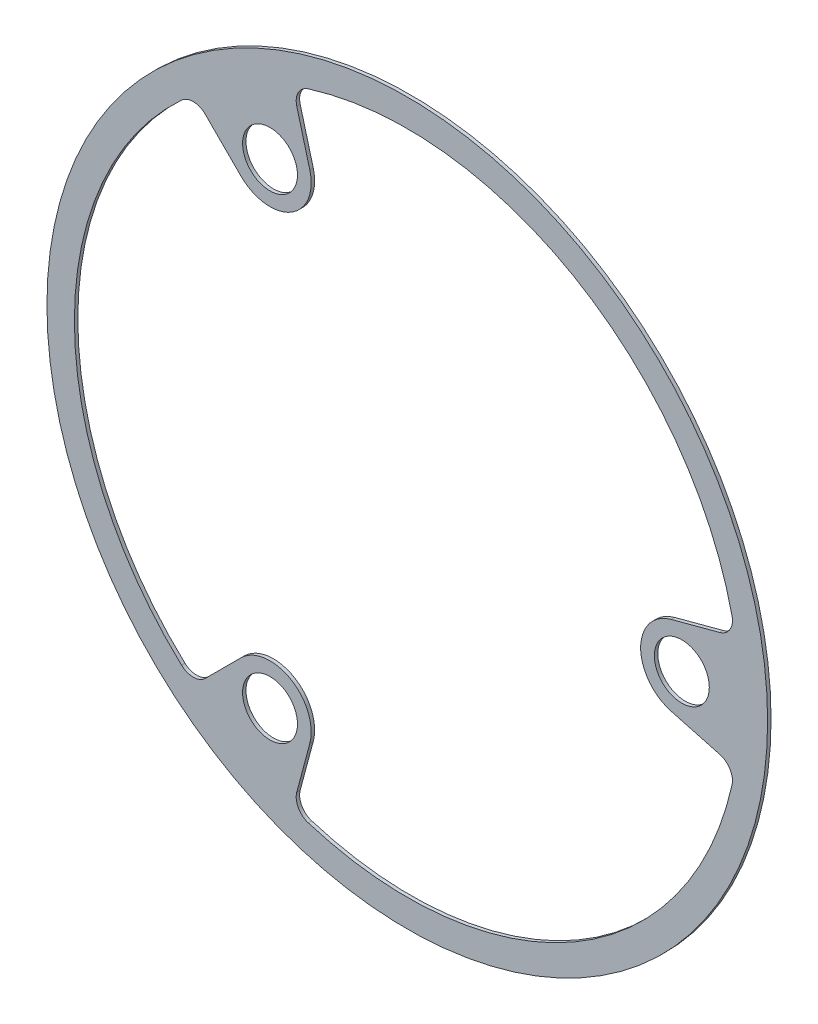
ISO-10303-21;
HEADER;
FILE_DESCRIPTION(('STEP AP214'),'2;1');
FILE_NAME('part.step','',(''),(''),'','','');
FILE_SCHEMA(('AUTOMOTIVE_DESIGN { 1 0 10303 214 1 1 1 1 }'));
ENDSEC;
DATA;
#1=APPLICATION_CONTEXT('core data for automotive mechanical design processes');
#2=APPLICATION_PROTOCOL_DEFINITION('international standard','automotive_design',2000,#1);
#3=PRODUCT_CONTEXT('',#1,'mechanical');
#4=PRODUCT('Part','Part','',(#3));
#5=PRODUCT_RELATED_PRODUCT_CATEGORY('part','',(#4));
#6=PRODUCT_DEFINITION_FORMATION('','',#4);
#7=PRODUCT_DEFINITION_CONTEXT('part definition',#1,'design');
#8=PRODUCT_DEFINITION('design','',#6,#7);
#9=PRODUCT_DEFINITION_SHAPE('','',#8);
#10=(LENGTH_UNIT() NAMED_UNIT(*) SI_UNIT(.MILLI.,.METRE.));
#11=(NAMED_UNIT(*) PLANE_ANGLE_UNIT() SI_UNIT($,.RADIAN.));
#12=(NAMED_UNIT(*) SI_UNIT($,.STERADIAN.) SOLID_ANGLE_UNIT());
#13=UNCERTAINTY_MEASURE_WITH_UNIT(LENGTH_MEASURE(1.E-05),#10,'distance_accuracy_value','');
#14=(GEOMETRIC_REPRESENTATION_CONTEXT(3) GLOBAL_UNCERTAINTY_ASSIGNED_CONTEXT((#13)) GLOBAL_UNIT_ASSIGNED_CONTEXT((#10,
#11,#12)) REPRESENTATION_CONTEXT('',''));
#15=CARTESIAN_POINT('',(0.,0.,0.));
#16=DIRECTION('',(0.,0.,1.));
#17=DIRECTION('',(1.,0.,0.));
#18=AXIS2_PLACEMENT_3D('',#15,#16,#17);
#19=CARTESIAN_POINT('',(-40.0000000000032,69.2820323027534,1.));
#20=DIRECTION('',(0.,0.,-1.));
#21=DIRECTION('',(-1.,0.,0.));
#22=AXIS2_PLACEMENT_3D('',#19,#20,#21);
#23=CYLINDRICAL_SURFACE('',#22,12.);
#24=CARTESIAN_POINT('',(-40.0000000000032,69.2820323027534,0.));
#25=DIRECTION('',(0.,0.,1.));
#26=DIRECTION('',(1.,0.,0.));
#27=AXIS2_PLACEMENT_3D('',#24,#25,#26);
#28=CIRCLE('',#27,12.);
#29=CARTESIAN_POINT('',(-28.4088900845345,72.3878608439841,0.));
#30=VERTEX_POINT('',#29);
#31=CARTESIAN_POINT('',(-48.4852813742413,60.7967509285144,0.));
#32=VERTEX_POINT('',#31);
#33=EDGE_CURVE('E192',#30,#32,#28,.F.);
#34=ORIENTED_EDGE('',*,*,#33,.F.);
#35=DIRECTION('',(0.,0.,-1.));
#36=VECTOR('',#35,1.);
#37=CARTESIAN_POINT('',(-28.4088900845345,72.3878608439841,1.));
#38=LINE('',#37,#36);
#39=CARTESIAN_POINT('',(-28.4088900845345,72.3878608439841,1.));
#40=VERTEX_POINT('',#39);
#41=EDGE_CURVE('E187',#40,#30,#38,.T.);
#42=ORIENTED_EDGE('',*,*,#41,.F.);
#43=CARTESIAN_POINT('',(-40.0000000000032,69.2820323027534,1.));
#44=DIRECTION('',(0.,0.,1.));
#45=DIRECTION('',(1.,0.,0.));
#46=AXIS2_PLACEMENT_3D('',#43,#44,#45);
#47=CIRCLE('',#46,12.);
#48=CARTESIAN_POINT('',(-48.4852813742413,60.7967509285144,1.));
#49=VERTEX_POINT('',#48);
#50=EDGE_CURVE('E189',#40,#49,#47,.F.);
#51=ORIENTED_EDGE('',*,*,#50,.T.);
#52=DIRECTION('',(0.,0.,-1.));
#53=VECTOR('',#52,1.);
#54=CARTESIAN_POINT('',(-48.4852813742413,60.7967509285144,1.));
#55=LINE('',#54,#53);
#56=EDGE_CURVE('E242',#49,#32,#55,.T.);
#57=ORIENTED_EDGE('',*,*,#56,.T.);
#58=EDGE_LOOP('',(#34,#42,#51,#57));
#59=FACE_BOUND('',#58,.T.);
#60=ADVANCED_FACE('F62',(#59),#23,.T.);
#61=CARTESIAN_POINT('',(-8.40889008453115,-2.2531553073926,1.));
#62=DIRECTION('',(-0.965925826289057,-0.258819045102564,0.));
#63=DIRECTION('',(0.258819045102564,-0.965925826289057,0.));
#64=AXIS2_PLACEMENT_3D('',#61,#62,#63);
#65=PLANE('',#64);
#66=DIRECTION('',(-0.258819045102564,0.965925826289057,0.));
#67=VECTOR('',#66,1.);
#68=CARTESIAN_POINT('',(-8.40889008453115,-2.2531553073926,0.));
#69=LINE('',#68,#67);
#70=CARTESIAN_POINT('',(-32.2009201564647,86.5399097362541,0.));
#71=VERTEX_POINT('',#70);
#72=EDGE_CURVE('E250',#30,#71,#69,.T.);
#73=ORIENTED_EDGE('',*,*,#72,.T.);
#74=DIRECTION('',(0.,0.,-1.));
#75=VECTOR('',#74,1.);
#76=CARTESIAN_POINT('',(-32.2009201564647,86.5399097362541,1.));
#77=LINE('',#76,#75);
#78=CARTESIAN_POINT('',(-32.2009201564647,86.5399097362541,1.));
#79=VERTEX_POINT('',#78);
#80=EDGE_CURVE('E77',#71,#79,#77,.F.);
#81=ORIENTED_EDGE('',*,*,#80,.T.);
#82=DIRECTION('',(-0.258819045102564,0.965925826289057,0.));
#83=VECTOR('',#82,1.);
#84=CARTESIAN_POINT('',(-8.40889008453115,-2.2531553073926,1.));
#85=LINE('',#84,#83);
#86=EDGE_CURVE('E196',#40,#79,#85,.T.);
#87=ORIENTED_EDGE('',*,*,#86,.F.);
#88=ORIENTED_EDGE('',*,*,#41,.T.);
#89=EDGE_LOOP('',(#73,#81,#87,#88));
#90=FACE_BOUND('',#89,.T.);
#91=ADVANCED_FACE('F197',(#90),#65,.F.);
#92=CARTESIAN_POINT('',(0.,0.,1.));
#93=DIRECTION('',(0.,0.,-1.));
#94=DIRECTION('',(-1.,0.,0.));
#95=AXIS2_PLACEMENT_3D('',#92,#93,#94);
#96=CYLINDRICAL_SURFACE('',#95,97.);
#97=CARTESIAN_POINT('',(0.,0.,0.));
#98=DIRECTION('',(0.,0.,1.));
#99=DIRECTION('',(1.,0.,0.));
#100=AXIS2_PLACEMENT_3D('',#97,#98,#99);
#101=CIRCLE('',#100,97.);
#102=CARTESIAN_POINT('',(94.6299580127843,21.3112891796504,0.));
#103=VERTEX_POINT('',#102);
#104=CARTESIAN_POINT('',(-28.8588611894226,92.6075921879499,0.));
#105=VERTEX_POINT('',#104);
#106=EDGE_CURVE('E252',#103,#105,#101,.T.);
#107=ORIENTED_EDGE('',*,*,#106,.F.);
#108=DIRECTION('',(0.,0.,-1.));
#109=VECTOR('',#108,1.);
#110=CARTESIAN_POINT('',(94.6299580127843,21.3112891796504,1.));
#111=LINE('',#110,#109);
#112=CARTESIAN_POINT('',(94.6299580127843,21.3112891796504,1.));
#113=VERTEX_POINT('',#112);
#114=EDGE_CURVE('E311',#103,#113,#111,.F.);
#115=ORIENTED_EDGE('',*,*,#114,.T.);
#116=CARTESIAN_POINT('',(0.,0.,1.));
#117=DIRECTION('',(0.,0.,1.));
#118=DIRECTION('',(1.,0.,0.));
#119=AXIS2_PLACEMENT_3D('',#116,#117,#118);
#120=CIRCLE('',#119,97.);
#121=CARTESIAN_POINT('',(-28.8588611894226,92.6075921879499,1.));
#122=VERTEX_POINT('',#121);
#123=EDGE_CURVE('E200',#113,#122,#120,.T.);
#124=ORIENTED_EDGE('',*,*,#123,.T.);
#125=DIRECTION('',(0.,0.,-1.));
#126=VECTOR('',#125,1.);
#127=CARTESIAN_POINT('',(-28.8588611894226,92.6075921879499,1.));
#128=LINE('',#127,#126);
#129=EDGE_CURVE('E308',#122,#105,#128,.T.);
#130=ORIENTED_EDGE('',*,*,#129,.T.);
#131=EDGE_LOOP('',(#107,#115,#124,#130));
#132=FACE_BOUND('',#131,.T.);
#133=ADVANCED_FACE('F373',(#132),#96,.F.);
#134=CARTESIAN_POINT('',(2.25315530739224,-8.40889008453127,1.));
#135=DIRECTION('',(-0.258819045102521,0.965925826289068,0.));
#136=DIRECTION('',(-0.965925826289068,-0.258819045102521,0.));
#137=AXIS2_PLACEMENT_3D('',#134,#135,#136);
#138=PLANE('',#137);
#139=DIRECTION('',(0.965925826289068,0.258819045102522,0.));
#140=VECTOR('',#139,1.);
#141=CARTESIAN_POINT('',(2.25315530739224,-8.40889008453127,1.));
#142=LINE('',#141,#140);
#143=CARTESIAN_POINT('',(76.8941714587698,11.5911099154688,1.));
#144=VERTEX_POINT('',#143);
#145=CARTESIAN_POINT('',(91.04622035104,15.3831399873984,1.));
#146=VERTEX_POINT('',#145);
#147=EDGE_CURVE('E215',#144,#146,#142,.T.);
#148=ORIENTED_EDGE('',*,*,#147,.T.);
#149=DIRECTION('',(0.,0.,1.));
#150=VECTOR('',#149,1.);
#151=CARTESIAN_POINT('',(91.0462203510399,15.3831399873984,0.));
#152=LINE('',#151,#150);
#153=CARTESIAN_POINT('',(91.04622035104,15.3831399873984,0.));
#154=VERTEX_POINT('',#153);
#155=EDGE_CURVE('E305',#146,#154,#152,.F.);
#156=ORIENTED_EDGE('',*,*,#155,.T.);
#157=DIRECTION('',(0.965925826289068,0.258819045102522,0.));
#158=VECTOR('',#157,1.);
#159=CARTESIAN_POINT('',(2.25315530739224,-8.40889008453127,0.));
#160=LINE('',#159,#158);
#161=CARTESIAN_POINT('',(76.8941714587698,11.5911099154688,0.));
#162=VERTEX_POINT('',#161);
#163=EDGE_CURVE('E254',#162,#154,#160,.T.);
#164=ORIENTED_EDGE('',*,*,#163,.F.);
#165=DIRECTION('',(0.,0.,-1.));
#166=VECTOR('',#165,1.);
#167=CARTESIAN_POINT('',(76.8941714587698,11.5911099154688,1.));
#168=LINE('',#167,#166);
#169=EDGE_CURVE('E194',#144,#162,#168,.T.);
#170=ORIENTED_EDGE('',*,*,#169,.F.);
#171=EDGE_LOOP('',(#148,#156,#164,#170));
#172=FACE_BOUND('',#171,.T.);
#173=ADVANCED_FACE('F364',(#172),#138,.T.);
#174=CARTESIAN_POINT('',(80.0000000000001,0.,1.));
#175=DIRECTION('',(0.,0.,-1.));
#176=DIRECTION('',(-1.,0.,0.));
#177=AXIS2_PLACEMENT_3D('',#174,#175,#176);
#178=CYLINDRICAL_SURFACE('',#177,12.);
#179=CARTESIAN_POINT('',(80.0000000000001,0.,0.));
#180=DIRECTION('',(0.,0.,1.));
#181=DIRECTION('',(1.,0.,0.));
#182=AXIS2_PLACEMENT_3D('',#179,#180,#181);
#183=CIRCLE('',#182,12.);
#184=CARTESIAN_POINT('',(76.8941714587698,-11.5911099154688,0.));
#185=VERTEX_POINT('',#184);
#186=EDGE_CURVE('E259',#185,#162,#183,.F.);
#187=ORIENTED_EDGE('',*,*,#186,.F.);
#188=DIRECTION('',(0.,0.,-1.));
#189=VECTOR('',#188,1.);
#190=CARTESIAN_POINT('',(76.8941714587698,-11.5911099154688,1.));
#191=LINE('',#190,#189);
#192=CARTESIAN_POINT('',(76.8941714587698,-11.5911099154688,1.));
#193=VERTEX_POINT('',#192);
#194=EDGE_CURVE('E288',#193,#185,#191,.T.);
#195=ORIENTED_EDGE('',*,*,#194,.F.);
#196=CARTESIAN_POINT('',(80.0000000000001,0.,1.));
#197=DIRECTION('',(0.,0.,1.));
#198=DIRECTION('',(1.,0.,0.));
#199=AXIS2_PLACEMENT_3D('',#196,#197,#198);
#200=CIRCLE('',#199,12.);
#201=EDGE_CURVE('E220',#193,#144,#200,.F.);
#202=ORIENTED_EDGE('',*,*,#201,.T.);
#203=ORIENTED_EDGE('',*,*,#169,.T.);
#204=EDGE_LOOP('',(#187,#195,#202,#203));
#205=FACE_BOUND('',#204,.T.);
#206=ADVANCED_FACE('F360',(#205),#178,.T.);
#207=CARTESIAN_POINT('',(2.25315530739223,8.40889008453127,1.));
#208=DIRECTION('',(0.258819045102521,0.965925826289068,0.));
#209=DIRECTION('',(-0.965925826289068,0.258819045102521,0.));
#210=AXIS2_PLACEMENT_3D('',#207,#208,#209);
#211=PLANE('',#210);
#212=DIRECTION('',(0.965925826289068,-0.258819045102521,0.));
#213=VECTOR('',#212,1.);
#214=CARTESIAN_POINT('',(2.25315530739223,8.40889008453127,0.));
#215=LINE('',#214,#213);
#216=CARTESIAN_POINT('',(91.04622035104,-15.3831399873984,0.));
#217=VERTEX_POINT('',#216);
#218=EDGE_CURVE('E262',#185,#217,#215,.T.);
#219=ORIENTED_EDGE('',*,*,#218,.T.);
#220=DIRECTION('',(0.,0.,-1.));
#221=VECTOR('',#220,1.);
#222=CARTESIAN_POINT('',(91.0462203510399,-15.3831399873984,1.));
#223=LINE('',#222,#221);
#224=CARTESIAN_POINT('',(91.04622035104,-15.3831399873984,1.));
#225=VERTEX_POINT('',#224);
#226=EDGE_CURVE('E316',#217,#225,#223,.F.);
#227=ORIENTED_EDGE('',*,*,#226,.T.);
#228=DIRECTION('',(0.965925826289068,-0.258819045102521,0.));
#229=VECTOR('',#228,1.);
#230=CARTESIAN_POINT('',(2.25315530739223,8.40889008453127,1.));
#231=LINE('',#230,#229);
#232=EDGE_CURVE('E223',#193,#225,#231,.T.);
#233=ORIENTED_EDGE('',*,*,#232,.F.);
#234=ORIENTED_EDGE('',*,*,#194,.T.);
#235=EDGE_LOOP('',(#219,#227,#233,#234));
#236=FACE_BOUND('',#235,.T.);
#237=ADVANCED_FACE('F358',(#236),#211,.F.);
#238=CARTESIAN_POINT('',(-28.8588611894169,-92.6075921879517,0.));
#239=VERTEX_POINT('',#238);
#240=CARTESIAN_POINT('',(94.6299580127843,-21.3112891796504,0.));
#241=VERTEX_POINT('',#240);
#242=EDGE_CURVE('E256',#239,#241,#101,.T.);
#243=ORIENTED_EDGE('',*,*,#242,.F.);
#244=DIRECTION('',(0.,0.,-1.));
#245=VECTOR('',#244,1.);
#246=CARTESIAN_POINT('',(-28.8588611894169,-92.6075921879517,1.));
#247=LINE('',#246,#245);
#248=CARTESIAN_POINT('',(-28.8588611894169,-92.6075921879517,1.));
#249=VERTEX_POINT('',#248);
#250=EDGE_CURVE('E296',#239,#249,#247,.F.);
#251=ORIENTED_EDGE('',*,*,#250,.T.);
#252=CARTESIAN_POINT('',(94.6299580127843,-21.3112891796504,1.));
#253=VERTEX_POINT('',#252);
#254=EDGE_CURVE('E217',#249,#253,#120,.T.);
#255=ORIENTED_EDGE('',*,*,#254,.T.);
#256=DIRECTION('',(0.,0.,-1.));
#257=VECTOR('',#256,1.);
#258=CARTESIAN_POINT('',(94.6299580127843,-21.3112891796504,1.));
#259=LINE('',#258,#257);
#260=EDGE_CURVE('E293',#253,#241,#259,.T.);
#261=ORIENTED_EDGE('',*,*,#260,.T.);
#262=EDGE_LOOP('',(#243,#251,#255,#261));
#263=FACE_BOUND('',#262,.T.);
#264=ADVANCED_FACE('F349',(#263),#96,.F.);
#265=CARTESIAN_POINT('',(-8.40889008454167,2.25315530739383,1.));
#266=DIRECTION('',(0.965925826289102,-0.258819045102394,0.));
#267=DIRECTION('',(0.258819045102394,0.965925826289102,0.));
#268=AXIS2_PLACEMENT_3D('',#265,#266,#267);
#269=PLANE('',#268);
#270=DIRECTION('',(-0.258819045102394,-0.965925826289102,0.));
#271=VECTOR('',#270,1.);
#272=CARTESIAN_POINT('',(-8.40889008454167,2.25315530739383,1.));
#273=LINE('',#272,#271);
#274=CARTESIAN_POINT('',(-28.4088900845316,-72.3878608439853,1.));
#275=VERTEX_POINT('',#274);
#276=CARTESIAN_POINT('',(-32.2009201564595,-86.5399097362567,1.));
#277=VERTEX_POINT('',#276);
#278=EDGE_CURVE('E226',#275,#277,#273,.T.);
#279=ORIENTED_EDGE('',*,*,#278,.T.);
#280=DIRECTION('',(0.,0.,1.));
#281=VECTOR('',#280,1.);
#282=CARTESIAN_POINT('',(-32.2009201564595,-86.5399097362566,0.));
#283=LINE('',#282,#281);
#284=CARTESIAN_POINT('',(-32.2009201564595,-86.5399097362567,0.));
#285=VERTEX_POINT('',#284);
#286=EDGE_CURVE('E193',#277,#285,#283,.F.);
#287=ORIENTED_EDGE('',*,*,#286,.T.);
#288=DIRECTION('',(-0.258819045102394,-0.965925826289102,0.));
#289=VECTOR('',#288,1.);
#290=CARTESIAN_POINT('',(-8.40889008454167,2.25315530739383,0.));
#291=LINE('',#290,#289);
#292=CARTESIAN_POINT('',(-28.4088900845316,-72.3878608439853,0.));
#293=VERTEX_POINT('',#292);
#294=EDGE_CURVE('E265',#293,#285,#291,.T.);
#295=ORIENTED_EDGE('',*,*,#294,.F.);
#296=DIRECTION('',(0.,0.,-1.));
#297=VECTOR('',#296,1.);
#298=CARTESIAN_POINT('',(-28.4088900845316,-72.3878608439853,1.));
#299=LINE('',#298,#297);
#300=EDGE_CURVE('E286',#275,#293,#299,.T.);
#301=ORIENTED_EDGE('',*,*,#300,.F.);
#302=EDGE_LOOP('',(#279,#287,#295,#301));
#303=FACE_BOUND('',#302,.T.);
#304=ADVANCED_FACE('F438',(#303),#269,.T.);
#305=CARTESIAN_POINT('',(-40.0000000000004,-69.282032302755,1.));
#306=DIRECTION('',(0.,0.,-1.));
#307=DIRECTION('',(-1.,0.,0.));
#308=AXIS2_PLACEMENT_3D('',#305,#306,#307);
#309=CYLINDRICAL_SURFACE('',#308,12.);
#310=CARTESIAN_POINT('',(-40.0000000000004,-69.282032302755,0.));
#311=DIRECTION('',(0.,0.,1.));
#312=DIRECTION('',(1.,0.,0.));
#313=AXIS2_PLACEMENT_3D('',#310,#311,#312);
#314=CIRCLE('',#313,12.);
#315=CARTESIAN_POINT('',(-48.4852813742389,-60.7967509285164,0.));
#316=VERTEX_POINT('',#315);
#317=EDGE_CURVE('E268',#316,#293,#314,.F.);
#318=ORIENTED_EDGE('',*,*,#317,.F.);
#319=DIRECTION('',(0.,0.,-1.));
#320=VECTOR('',#319,1.);
#321=CARTESIAN_POINT('',(-48.4852813742389,-60.7967509285164,1.));
#322=LINE('',#321,#320);
#323=CARTESIAN_POINT('',(-48.4852813742389,-60.7967509285164,1.));
#324=VERTEX_POINT('',#323);
#325=EDGE_CURVE('E284',#324,#316,#322,.T.);
#326=ORIENTED_EDGE('',*,*,#325,.F.);
#327=CARTESIAN_POINT('',(-40.0000000000004,-69.282032302755,1.));
#328=DIRECTION('',(0.,0.,1.));
#329=DIRECTION('',(1.,0.,0.));
#330=AXIS2_PLACEMENT_3D('',#327,#328,#329);
#331=CIRCLE('',#330,12.);
#332=EDGE_CURVE('E229',#324,#275,#331,.F.);
#333=ORIENTED_EDGE('',*,*,#332,.T.);
#334=ORIENTED_EDGE('',*,*,#300,.T.);
#335=EDGE_LOOP('',(#318,#326,#333,#334));
#336=FACE_BOUND('',#335,.T.);
#337=ADVANCED_FACE('F435',(#336),#309,.T.);
#338=CARTESIAN_POINT('',(6.15573477713245,-6.15573477713085,1.));
#339=DIRECTION('',(0.707106781186639,-0.707106781186456,0.));
#340=DIRECTION('',(0.707106781186456,0.707106781186639,0.));
#341=AXIS2_PLACEMENT_3D('',#338,#339,#340);
#342=PLANE('',#341);
#343=DIRECTION('',(-0.707106781186456,-0.707106781186639,0.));
#344=VECTOR('',#343,1.);
#345=CARTESIAN_POINT('',(6.15573477713245,-6.15573477713085,0.));
#346=LINE('',#345,#344);
#347=CARTESIAN_POINT('',(-58.8453001945776,-71.1567697488578,0.));
#348=VERTEX_POINT('',#347);
#349=EDGE_CURVE('E271',#316,#348,#346,.T.);
#350=ORIENTED_EDGE('',*,*,#349,.T.);
#351=DIRECTION('',(0.,0.,-1.));
#352=VECTOR('',#351,1.);
#353=CARTESIAN_POINT('',(-58.8453001945776,-71.1567697488578,1.));
#354=LINE('',#353,#352);
#355=CARTESIAN_POINT('',(-58.8453001945776,-71.1567697488578,1.));
#356=VERTEX_POINT('',#355);
#357=EDGE_CURVE('E303',#348,#356,#354,.F.);
#358=ORIENTED_EDGE('',*,*,#357,.T.);
#359=DIRECTION('',(-0.707106781186456,-0.707106781186639,0.));
#360=VECTOR('',#359,1.);
#361=CARTESIAN_POINT('',(6.15573477713245,-6.15573477713085,1.));
#362=LINE('',#361,#360);
#363=EDGE_CURVE('E232',#324,#356,#362,.T.);
#364=ORIENTED_EDGE('',*,*,#363,.F.);
#365=ORIENTED_EDGE('',*,*,#325,.T.);
#366=EDGE_LOOP('',(#350,#358,#364,#365));
#367=FACE_BOUND('',#366,.T.);
#368=ADVANCED_FACE('F431',(#367),#342,.F.);
#369=CARTESIAN_POINT('',(-65.771096823369,71.2963030082978,1.));
#370=VERTEX_POINT('',#369);
#371=CARTESIAN_POINT('',(-65.7710968233646,-71.2963030083019,1.));
#372=VERTEX_POINT('',#371);
#373=EDGE_CURVE('E216',#370,#372,#120,.T.);
#374=ORIENTED_EDGE('',*,*,#373,.T.);
#375=DIRECTION('',(0.,0.,-1.));
#376=VECTOR('',#375,1.);
#377=CARTESIAN_POINT('',(-65.7710968233646,-71.2963030083019,1.));
#378=LINE('',#377,#376);
#379=CARTESIAN_POINT('',(-65.7710968233646,-71.2963030083019,0.));
#380=VERTEX_POINT('',#379);
#381=EDGE_CURVE('E300',#372,#380,#378,.T.);
#382=ORIENTED_EDGE('',*,*,#381,.T.);
#383=CARTESIAN_POINT('',(-65.771096823369,71.2963030082978,0.));
#384=VERTEX_POINT('',#383);
#385=EDGE_CURVE('E255',#384,#380,#101,.T.);
#386=ORIENTED_EDGE('',*,*,#385,.F.);
#387=DIRECTION('',(0.,0.,-1.));
#388=VECTOR('',#387,1.);
#389=CARTESIAN_POINT('',(-65.771096823369,71.2963030082978,1.));
#390=LINE('',#389,#388);
#391=EDGE_CURVE('E298',#384,#370,#390,.F.);
#392=ORIENTED_EDGE('',*,*,#391,.T.);
#393=EDGE_LOOP('',(#374,#382,#386,#392));
#394=FACE_BOUND('',#393,.T.);
#395=ADVANCED_FACE('F424',(#394),#96,.F.);
#396=CARTESIAN_POINT('',(0.,0.,1.));
#397=DIRECTION('',(0.,0.,-1.));
#398=DIRECTION('',(-1.,0.,0.));
#399=AXIS2_PLACEMENT_3D('',#396,#397,#398);
#400=CYLINDRICAL_SURFACE('',#399,105.);
#401=CARTESIAN_POINT('',(0.,0.,1.));
#402=DIRECTION('',(0.,0.,1.));
#403=DIRECTION('',(1.,0.,0.));
#404=AXIS2_PLACEMENT_3D('',#401,#402,#403);
#405=CIRCLE('',#404,105.);
#406=CARTESIAN_POINT('',(105.,0.,1.));
#407=VERTEX_POINT('',#406);
#408=EDGE_CURVE('E236',#407,#407,#405,.T.);
#409=ORIENTED_EDGE('',*,*,#408,.F.);
#410=EDGE_LOOP('',(#409));
#411=FACE_BOUND('',#410,.T.);
#412=CARTESIAN_POINT('',(0.,0.,0.));
#413=DIRECTION('',(0.,0.,1.));
#414=DIRECTION('',(1.,0.,0.));
#415=AXIS2_PLACEMENT_3D('',#412,#413,#414);
#416=CIRCLE('',#415,105.);
#417=CARTESIAN_POINT('',(105.,0.,0.));
#418=VERTEX_POINT('',#417);
#419=EDGE_CURVE('E277',#418,#418,#416,.T.);
#420=ORIENTED_EDGE('',*,*,#419,.T.);
#421=EDGE_LOOP('',(#420));
#422=FACE_BOUND('',#421,.T.);
#423=ADVANCED_FACE('F463',(#411,#422),#400,.T.);
#424=CARTESIAN_POINT('',(6.15573477713875,6.15573477713931,1.));
#425=DIRECTION('',(-0.707106781186515,-0.70710678118658,0.));
#426=DIRECTION('',(0.70710678118658,-0.707106781186515,0.));
#427=AXIS2_PLACEMENT_3D('',#424,#425,#426);
#428=PLANE('',#427);
#429=DIRECTION('',(-0.70710678118658,0.707106781186515,0.));
#430=VECTOR('',#429,1.);
#431=CARTESIAN_POINT('',(6.15573477713875,6.15573477713931,1.));
#432=LINE('',#431,#430);
#433=CARTESIAN_POINT('',(-58.8453001945824,71.1567697488545,1.));
#434=VERTEX_POINT('',#433);
#435=EDGE_CURVE('E205',#49,#434,#432,.T.);
#436=ORIENTED_EDGE('',*,*,#435,.T.);
#437=DIRECTION('',(0.,0.,1.));
#438=VECTOR('',#437,1.);
#439=CARTESIAN_POINT('',(-58.8453001945824,71.1567697488545,0.));
#440=LINE('',#439,#438);
#441=CARTESIAN_POINT('',(-58.8453001945824,71.1567697488545,0.));
#442=VERTEX_POINT('',#441);
#443=EDGE_CURVE('E313',#434,#442,#440,.F.);
#444=ORIENTED_EDGE('',*,*,#443,.T.);
#445=DIRECTION('',(-0.70710678118658,0.707106781186515,0.));
#446=VECTOR('',#445,1.);
#447=CARTESIAN_POINT('',(6.15573477713875,6.15573477713931,0.));
#448=LINE('',#447,#446);
#449=EDGE_CURVE('E274',#32,#442,#448,.T.);
#450=ORIENTED_EDGE('',*,*,#449,.F.);
#451=ORIENTED_EDGE('',*,*,#56,.F.);
#452=EDGE_LOOP('',(#436,#444,#450,#451));
#453=FACE_BOUND('',#452,.T.);
#454=ADVANCED_FACE('F394',(#453),#428,.T.);
#455=CARTESIAN_POINT('',(-40.0000000000032,69.2820323027534,1.));
#456=DIRECTION('',(0.,0.,-1.));
#457=DIRECTION('',(-1.,0.,0.));
#458=AXIS2_PLACEMENT_3D('',#455,#456,#457);
#459=CYLINDRICAL_SURFACE('',#458,7.99999999999873);
#460=CARTESIAN_POINT('',(-40.0000000000032,69.2820323027534,1.));
#461=DIRECTION('',(0.,0.,1.));
#462=DIRECTION('',(1.,0.,0.));
#463=AXIS2_PLACEMENT_3D('',#460,#461,#462);
#464=CIRCLE('',#463,7.99999999999873);
#465=CARTESIAN_POINT('',(-32.0000000000044,69.2820323027534,1.));
#466=VERTEX_POINT('',#465);
#467=EDGE_CURVE('E206',#466,#466,#464,.T.);
#468=ORIENTED_EDGE('',*,*,#467,.T.);
#469=EDGE_LOOP('',(#468));
#470=FACE_BOUND('',#469,.T.);
#471=CARTESIAN_POINT('',(-40.0000000000032,69.2820323027534,0.));
#472=DIRECTION('',(0.,0.,1.));
#473=DIRECTION('',(1.,0.,0.));
#474=AXIS2_PLACEMENT_3D('',#471,#472,#473);
#475=CIRCLE('',#474,7.99999999999873);
#476=CARTESIAN_POINT('',(-32.0000000000044,69.2820323027534,0.));
#477=VERTEX_POINT('',#476);
#478=EDGE_CURVE('E246',#477,#477,#475,.T.);
#479=ORIENTED_EDGE('',*,*,#478,.F.);
#480=EDGE_LOOP('',(#479));
#481=FACE_BOUND('',#480,.T.);
#482=ADVANCED_FACE('F390',(#470,#481),#459,.F.);
#483=CARTESIAN_POINT('',(80.0000000000001,0.,1.));
#484=DIRECTION('',(0.,0.,-1.));
#485=DIRECTION('',(-1.,0.,0.));
#486=AXIS2_PLACEMENT_3D('',#483,#484,#485);
#487=CYLINDRICAL_SURFACE('',#486,8.);
#488=CARTESIAN_POINT('',(80.0000000000001,0.,1.));
#489=DIRECTION('',(0.,0.,1.));
#490=DIRECTION('',(1.,0.,0.));
#491=AXIS2_PLACEMENT_3D('',#488,#489,#490);
#492=CIRCLE('',#491,8.);
#493=CARTESIAN_POINT('',(88.0000000000001,0.,1.));
#494=VERTEX_POINT('',#493);
#495=EDGE_CURVE('E209',#494,#494,#492,.T.);
#496=ORIENTED_EDGE('',*,*,#495,.T.);
#497=EDGE_LOOP('',(#496));
#498=FACE_BOUND('',#497,.T.);
#499=CARTESIAN_POINT('',(80.0000000000001,0.,0.));
#500=DIRECTION('',(0.,0.,1.));
#501=DIRECTION('',(1.,0.,0.));
#502=AXIS2_PLACEMENT_3D('',#499,#500,#501);
#503=CIRCLE('',#502,8.);
#504=CARTESIAN_POINT('',(88.0000000000001,0.,0.));
#505=VERTEX_POINT('',#504);
#506=EDGE_CURVE('E243',#505,#505,#503,.T.);
#507=ORIENTED_EDGE('',*,*,#506,.F.);
#508=EDGE_LOOP('',(#507));
#509=FACE_BOUND('',#508,.T.);
#510=ADVANCED_FACE('F393',(#498,#509),#487,.F.);
#511=CARTESIAN_POINT('',(-40.0000000000004,-69.282032302755,1.));
#512=DIRECTION('',(0.,0.,-1.));
#513=DIRECTION('',(-1.,0.,0.));
#514=AXIS2_PLACEMENT_3D('',#511,#512,#513);
#515=CYLINDRICAL_SURFACE('',#514,7.99999999999999);
#516=CARTESIAN_POINT('',(-40.0000000000004,-69.282032302755,1.));
#517=DIRECTION('',(0.,0.,1.));
#518=DIRECTION('',(1.,0.,0.));
#519=AXIS2_PLACEMENT_3D('',#516,#517,#518);
#520=CIRCLE('',#519,7.99999999999999);
#521=CARTESIAN_POINT('',(-32.0000000000004,-69.282032302755,1.));
#522=VERTEX_POINT('',#521);
#523=EDGE_CURVE('E239',#522,#522,#520,.T.);
#524=ORIENTED_EDGE('',*,*,#523,.T.);
#525=EDGE_LOOP('',(#524));
#526=FACE_BOUND('',#525,.T.);
#527=CARTESIAN_POINT('',(-40.0000000000004,-69.282032302755,0.));
#528=DIRECTION('',(0.,0.,1.));
#529=DIRECTION('',(1.,0.,0.));
#530=AXIS2_PLACEMENT_3D('',#527,#528,#529);
#531=CIRCLE('',#530,7.99999999999999);
#532=CARTESIAN_POINT('',(-32.0000000000004,-69.282032302755,0.));
#533=VERTEX_POINT('',#532);
#534=EDGE_CURVE('E280',#533,#533,#531,.T.);
#535=ORIENTED_EDGE('',*,*,#534,.F.);
#536=EDGE_LOOP('',(#535));
#537=FACE_BOUND('',#536,.T.);
#538=ADVANCED_FACE('F398',(#526,#537),#515,.F.);
#539=CARTESIAN_POINT('',(0.,0.,1.));
#540=DIRECTION('',(0.,0.,1.));
#541=DIRECTION('',(1.,0.,0.));
#542=AXIS2_PLACEMENT_3D('',#539,#540,#541);
#543=PLANE('',#542);
#544=ORIENTED_EDGE('',*,*,#495,.F.);
#545=EDGE_LOOP('',(#544));
#546=FACE_BOUND('',#545,.T.);
#547=ORIENTED_EDGE('',*,*,#467,.F.);
#548=EDGE_LOOP('',(#547));
#549=FACE_BOUND('',#548,.T.);
#550=ORIENTED_EDGE('',*,*,#50,.F.);
#551=ORIENTED_EDGE('',*,*,#86,.T.);
#552=CARTESIAN_POINT('',(-27.3712910250194,87.8340049617669,1.));
#553=DIRECTION('',(0.,0.,1.));
#554=DIRECTION('',(1.,0.,0.));
#555=AXIS2_PLACEMENT_3D('',#552,#553,#554);
#556=CIRCLE('',#555,5.);
#557=EDGE_CURVE('E14',#79,#122,#556,.F.);
#558=ORIENTED_EDGE('',*,*,#557,.T.);
#559=ORIENTED_EDGE('',*,*,#123,.F.);
#560=CARTESIAN_POINT('',(89.7521251255273,20.2127691188437,1.));
#561=DIRECTION('',(0.,0.,1.));
#562=DIRECTION('',(1.,0.,0.));
#563=AXIS2_PLACEMENT_3D('',#560,#561,#562);
#564=CIRCLE('',#563,5.);
#565=EDGE_CURVE('E329',#113,#146,#564,.F.);
#566=ORIENTED_EDGE('',*,*,#565,.T.);
#567=ORIENTED_EDGE('',*,*,#147,.F.);
#568=ORIENTED_EDGE('',*,*,#201,.F.);
#569=ORIENTED_EDGE('',*,*,#232,.T.);
#570=CARTESIAN_POINT('',(89.7521251255273,-20.2127691188437,1.));
#571=DIRECTION('',(0.,0.,1.));
#572=DIRECTION('',(1.,0.,0.));
#573=AXIS2_PLACEMENT_3D('',#570,#571,#572);
#574=CIRCLE('',#573,5.);
#575=EDGE_CURVE('E337',#225,#253,#574,.F.);
#576=ORIENTED_EDGE('',*,*,#575,.T.);
#577=ORIENTED_EDGE('',*,*,#254,.F.);
#578=CARTESIAN_POINT('',(-27.3712910250139,-87.8340049617686,1.));
#579=DIRECTION('',(0.,0.,1.));
#580=DIRECTION('',(1.,0.,0.));
#581=AXIS2_PLACEMENT_3D('',#578,#579,#580);
#582=CIRCLE('',#581,5.);
#583=EDGE_CURVE('E321',#249,#277,#582,.F.);
#584=ORIENTED_EDGE('',*,*,#583,.T.);
#585=ORIENTED_EDGE('',*,*,#278,.F.);
#586=ORIENTED_EDGE('',*,*,#332,.F.);
#587=ORIENTED_EDGE('',*,*,#363,.T.);
#588=CARTESIAN_POINT('',(-62.3808341005108,-67.6212358429255,1.));
#589=DIRECTION('',(0.,0.,1.));
#590=DIRECTION('',(1.,0.,0.));
#591=AXIS2_PLACEMENT_3D('',#588,#589,#590);
#592=CIRCLE('',#591,5.);
#593=EDGE_CURVE('E325',#356,#372,#592,.F.);
#594=ORIENTED_EDGE('',*,*,#593,.T.);
#595=ORIENTED_EDGE('',*,*,#373,.F.);
#596=CARTESIAN_POINT('',(-62.380834100515,67.6212358429216,1.));
#597=DIRECTION('',(0.,0.,1.));
#598=DIRECTION('',(1.,0.,0.));
#599=AXIS2_PLACEMENT_3D('',#596,#597,#598);
#600=CIRCLE('',#599,5.);
#601=EDGE_CURVE('E333',#370,#434,#600,.F.);
#602=ORIENTED_EDGE('',*,*,#601,.T.);
#603=ORIENTED_EDGE('',*,*,#435,.F.);
#604=EDGE_LOOP('',(#550,#551,#558,#559,#566,#567,#568,#569,#576,#577,#584,#585,#586,#587,#594,
#595,#602,#603));
#605=FACE_BOUND('',#604,.T.);
#606=ORIENTED_EDGE('',*,*,#408,.T.);
#607=EDGE_LOOP('',(#606));
#608=FACE_BOUND('',#607,.T.);
#609=ORIENTED_EDGE('',*,*,#523,.F.);
#610=EDGE_LOOP('',(#609));
#611=FACE_BOUND('',#610,.T.);
#612=ADVANCED_FACE('F202',(#546,#549,#605,#608,#611),#543,.T.);
#613=CARTESIAN_POINT('',(0.,0.,0.));
#614=DIRECTION('',(0.,0.,1.));
#615=DIRECTION('',(1.,0.,0.));
#616=AXIS2_PLACEMENT_3D('',#613,#614,#615);
#617=PLANE('',#616);
#618=ORIENTED_EDGE('',*,*,#506,.T.);
#619=EDGE_LOOP('',(#618));
#620=FACE_BOUND('',#619,.T.);
#621=ORIENTED_EDGE('',*,*,#478,.T.);
#622=EDGE_LOOP('',(#621));
#623=FACE_BOUND('',#622,.T.);
#624=ORIENTED_EDGE('',*,*,#33,.T.);
#625=ORIENTED_EDGE('',*,*,#449,.T.);
#626=CARTESIAN_POINT('',(-62.380834100515,67.6212358429216,0.));
#627=DIRECTION('',(0.,0.,1.));
#628=DIRECTION('',(1.,0.,0.));
#629=AXIS2_PLACEMENT_3D('',#626,#627,#628);
#630=CIRCLE('',#629,5.);
#631=EDGE_CURVE('E331',#442,#384,#630,.T.);
#632=ORIENTED_EDGE('',*,*,#631,.T.);
#633=ORIENTED_EDGE('',*,*,#385,.T.);
#634=CARTESIAN_POINT('',(-62.3808341005108,-67.6212358429255,0.));
#635=DIRECTION('',(0.,0.,1.));
#636=DIRECTION('',(1.,0.,0.));
#637=AXIS2_PLACEMENT_3D('',#634,#635,#636);
#638=CIRCLE('',#637,5.);
#639=EDGE_CURVE('E323',#380,#348,#638,.T.);
#640=ORIENTED_EDGE('',*,*,#639,.T.);
#641=ORIENTED_EDGE('',*,*,#349,.F.);
#642=ORIENTED_EDGE('',*,*,#317,.T.);
#643=ORIENTED_EDGE('',*,*,#294,.T.);
#644=CARTESIAN_POINT('',(-27.3712910250139,-87.8340049617686,0.));
#645=DIRECTION('',(0.,0.,1.));
#646=DIRECTION('',(1.,0.,0.));
#647=AXIS2_PLACEMENT_3D('',#644,#645,#646);
#648=CIRCLE('',#647,5.);
#649=EDGE_CURVE('E319',#285,#239,#648,.T.);
#650=ORIENTED_EDGE('',*,*,#649,.T.);
#651=ORIENTED_EDGE('',*,*,#242,.T.);
#652=CARTESIAN_POINT('',(89.7521251255273,-20.2127691188437,0.));
#653=DIRECTION('',(0.,0.,1.));
#654=DIRECTION('',(1.,0.,0.));
#655=AXIS2_PLACEMENT_3D('',#652,#653,#654);
#656=CIRCLE('',#655,5.);
#657=EDGE_CURVE('E335',#241,#217,#656,.T.);
#658=ORIENTED_EDGE('',*,*,#657,.T.);
#659=ORIENTED_EDGE('',*,*,#218,.F.);
#660=ORIENTED_EDGE('',*,*,#186,.T.);
#661=ORIENTED_EDGE('',*,*,#163,.T.);
#662=CARTESIAN_POINT('',(89.7521251255273,20.2127691188437,0.));
#663=DIRECTION('',(0.,0.,1.));
#664=DIRECTION('',(1.,0.,0.));
#665=AXIS2_PLACEMENT_3D('',#662,#663,#664);
#666=CIRCLE('',#665,5.);
#667=EDGE_CURVE('E327',#154,#103,#666,.T.);
#668=ORIENTED_EDGE('',*,*,#667,.T.);
#669=ORIENTED_EDGE('',*,*,#106,.T.);
#670=CARTESIAN_POINT('',(-27.3712910250194,87.8340049617669,0.));
#671=DIRECTION('',(0.,0.,1.));
#672=DIRECTION('',(1.,0.,0.));
#673=AXIS2_PLACEMENT_3D('',#670,#671,#672);
#674=CIRCLE('',#673,5.);
#675=EDGE_CURVE('E70',#105,#71,#674,.T.);
#676=ORIENTED_EDGE('',*,*,#675,.T.);
#677=ORIENTED_EDGE('',*,*,#72,.F.);
#678=EDGE_LOOP('',(#624,#625,#632,#633,#640,#641,#642,#643,#650,#651,#658,#659,#660,#661,#668,
#669,#676,#677));
#679=FACE_BOUND('',#678,.T.);
#680=ORIENTED_EDGE('',*,*,#419,.F.);
#681=EDGE_LOOP('',(#680));
#682=FACE_BOUND('',#681,.T.);
#683=ORIENTED_EDGE('',*,*,#534,.T.);
#684=EDGE_LOOP('',(#683));
#685=FACE_BOUND('',#684,.T.);
#686=ADVANCED_FACE('F354',(#620,#623,#679,#682,#685),#617,.F.);
#687=CARTESIAN_POINT('',(-27.3712910250139,-87.8340049617686,1.));
#688=DIRECTION('',(0.,0.,-1.));
#689=DIRECTION('',(-1.,0.,0.));
#690=AXIS2_PLACEMENT_3D('',#687,#688,#689);
#691=CYLINDRICAL_SURFACE('',#690,5.);
#692=ORIENTED_EDGE('',*,*,#583,.F.);
#693=ORIENTED_EDGE('',*,*,#250,.F.);
#694=ORIENTED_EDGE('',*,*,#649,.F.);
#695=ORIENTED_EDGE('',*,*,#286,.F.);
#696=EDGE_LOOP('',(#692,#693,#694,#695));
#697=FACE_BOUND('',#696,.T.);
#698=ADVANCED_FACE('F400',(#697),#691,.F.);
#699=CARTESIAN_POINT('',(-62.3808341005108,-67.6212358429255,1.));
#700=DIRECTION('',(0.,0.,-1.));
#701=DIRECTION('',(-1.,0.,0.));
#702=AXIS2_PLACEMENT_3D('',#699,#700,#701);
#703=CYLINDRICAL_SURFACE('',#702,5.);
#704=ORIENTED_EDGE('',*,*,#593,.F.);
#705=ORIENTED_EDGE('',*,*,#357,.F.);
#706=ORIENTED_EDGE('',*,*,#639,.F.);
#707=ORIENTED_EDGE('',*,*,#381,.F.);
#708=EDGE_LOOP('',(#704,#705,#706,#707));
#709=FACE_BOUND('',#708,.T.);
#710=ADVANCED_FACE('F403',(#709),#703,.F.);
#711=CARTESIAN_POINT('',(89.7521251255273,20.2127691188437,1.));
#712=DIRECTION('',(0.,0.,-1.));
#713=DIRECTION('',(-1.,0.,0.));
#714=AXIS2_PLACEMENT_3D('',#711,#712,#713);
#715=CYLINDRICAL_SURFACE('',#714,5.);
#716=ORIENTED_EDGE('',*,*,#565,.F.);
#717=ORIENTED_EDGE('',*,*,#114,.F.);
#718=ORIENTED_EDGE('',*,*,#667,.F.);
#719=ORIENTED_EDGE('',*,*,#155,.F.);
#720=EDGE_LOOP('',(#716,#717,#718,#719));
#721=FACE_BOUND('',#720,.T.);
#722=ADVANCED_FACE('F369',(#721),#715,.F.);
#723=CARTESIAN_POINT('',(-62.380834100515,67.6212358429216,1.));
#724=DIRECTION('',(0.,0.,-1.));
#725=DIRECTION('',(-1.,0.,0.));
#726=AXIS2_PLACEMENT_3D('',#723,#724,#725);
#727=CYLINDRICAL_SURFACE('',#726,5.);
#728=ORIENTED_EDGE('',*,*,#601,.F.);
#729=ORIENTED_EDGE('',*,*,#391,.F.);
#730=ORIENTED_EDGE('',*,*,#631,.F.);
#731=ORIENTED_EDGE('',*,*,#443,.F.);
#732=EDGE_LOOP('',(#728,#729,#730,#731));
#733=FACE_BOUND('',#732,.T.);
#734=ADVANCED_FACE('F380',(#733),#727,.F.);
#735=CARTESIAN_POINT('',(89.7521251255273,-20.2127691188437,1.));
#736=DIRECTION('',(0.,0.,-1.));
#737=DIRECTION('',(-1.,0.,0.));
#738=AXIS2_PLACEMENT_3D('',#735,#736,#737);
#739=CYLINDRICAL_SURFACE('',#738,5.);
#740=ORIENTED_EDGE('',*,*,#575,.F.);
#741=ORIENTED_EDGE('',*,*,#226,.F.);
#742=ORIENTED_EDGE('',*,*,#657,.F.);
#743=ORIENTED_EDGE('',*,*,#260,.F.);
#744=EDGE_LOOP('',(#740,#741,#742,#743));
#745=FACE_BOUND('',#744,.T.);
#746=ADVANCED_FACE('F352',(#745),#739,.F.);
#747=CARTESIAN_POINT('',(-27.3712910250194,87.8340049617669,1.));
#748=DIRECTION('',(0.,0.,-1.));
#749=DIRECTION('',(-1.,0.,0.));
#750=AXIS2_PLACEMENT_3D('',#747,#748,#749);
#751=CYLINDRICAL_SURFACE('',#750,5.);
#752=ORIENTED_EDGE('',*,*,#557,.F.);
#753=ORIENTED_EDGE('',*,*,#80,.F.);
#754=ORIENTED_EDGE('',*,*,#675,.F.);
#755=ORIENTED_EDGE('',*,*,#129,.F.);
#756=EDGE_LOOP('',(#752,#753,#754,#755));
#757=FACE_BOUND('',#756,.T.);
#758=ADVANCED_FACE('F64',(#757),#751,.F.);
#759=CLOSED_SHELL('',(#60,#91,#133,#173,#206,#237,#264,#304,#337,#368,#395,#423,#454,#482,#510,
#538,#612,#686,#698,#710,#722,#734,#746,#758));
#760=MANIFOLD_SOLID_BREP('B2',#759);
#761=ADVANCED_BREP_SHAPE_REPRESENTATION('',(#18,#760),#14);
#762=SHAPE_DEFINITION_REPRESENTATION(#9,#761);
ENDSEC;
END-ISO-10303-21;
